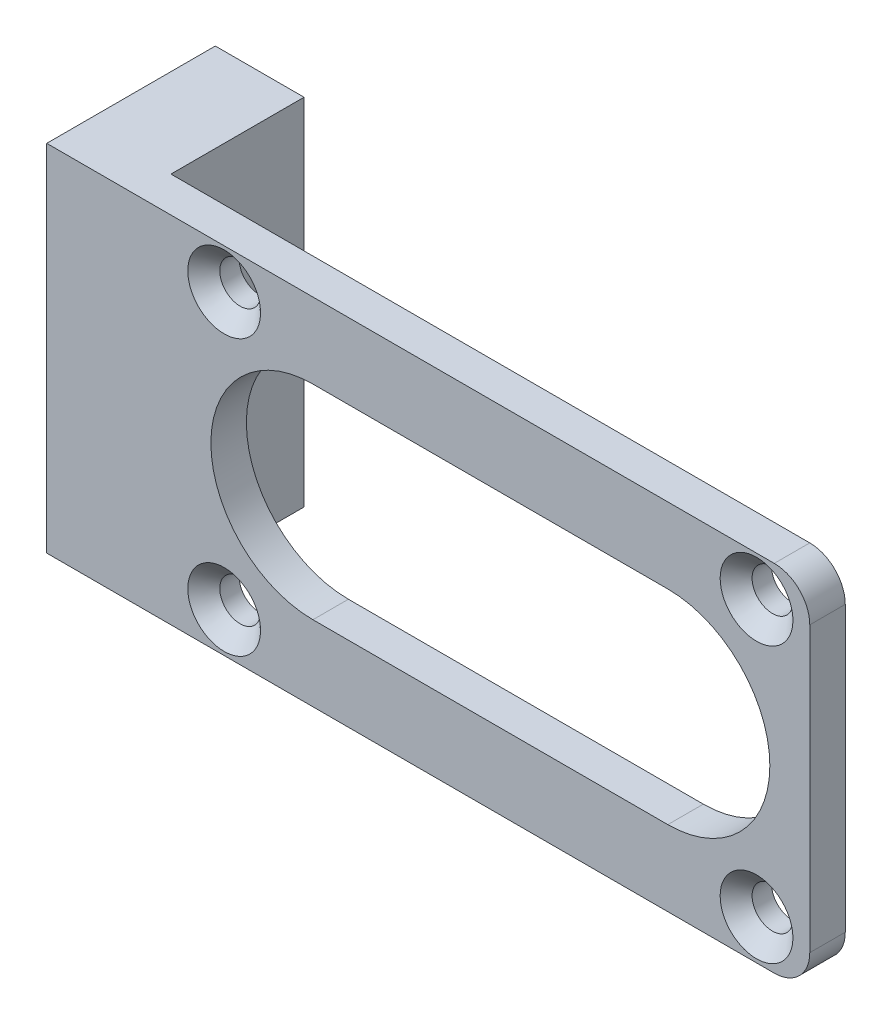
ISO-10303-21;
HEADER;
FILE_DESCRIPTION(('STEP AP214'),'2;1');
FILE_NAME('part.step','',(''),(''),'','','');
FILE_SCHEMA(('AUTOMOTIVE_DESIGN { 1 0 10303 214 1 1 1 1 }'));
ENDSEC;
DATA;
#1=APPLICATION_CONTEXT('core data for automotive mechanical design processes');
#2=APPLICATION_PROTOCOL_DEFINITION('international standard','automotive_design',2000,#1);
#3=PRODUCT_CONTEXT('',#1,'mechanical');
#4=PRODUCT('Part','Part','',(#3));
#5=PRODUCT_RELATED_PRODUCT_CATEGORY('part','',(#4));
#6=PRODUCT_DEFINITION_FORMATION('','',#4);
#7=PRODUCT_DEFINITION_CONTEXT('part definition',#1,'design');
#8=PRODUCT_DEFINITION('design','',#6,#7);
#9=PRODUCT_DEFINITION_SHAPE('','',#8);
#10=(LENGTH_UNIT() NAMED_UNIT(*) SI_UNIT(.MILLI.,.METRE.));
#11=(NAMED_UNIT(*) PLANE_ANGLE_UNIT() SI_UNIT($,.RADIAN.));
#12=(NAMED_UNIT(*) SI_UNIT($,.STERADIAN.) SOLID_ANGLE_UNIT());
#13=UNCERTAINTY_MEASURE_WITH_UNIT(LENGTH_MEASURE(1.E-05),#10,'distance_accuracy_value','');
#14=(GEOMETRIC_REPRESENTATION_CONTEXT(3) GLOBAL_UNCERTAINTY_ASSIGNED_CONTEXT((#13)) GLOBAL_UNIT_ASSIGNED_CONTEXT((#10,
#11,#12)) REPRESENTATION_CONTEXT('',''));
#15=CARTESIAN_POINT('',(0.,0.,0.));
#16=DIRECTION('',(0.,0.,1.));
#17=DIRECTION('',(1.,0.,0.));
#18=AXIS2_PLACEMENT_3D('',#15,#16,#17);
#19=CARTESIAN_POINT('',(0.,0.,2.));
#20=DIRECTION('',(0.,1.,0.));
#21=DIRECTION('',(0.,0.,1.));
#22=AXIS2_PLACEMENT_3D('',#19,#20,#21);
#23=PLANE('',#22);
#24=DIRECTION('',(1.,0.,0.));
#25=VECTOR('',#24,1.);
#26=CARTESIAN_POINT('',(0.,0.,0.));
#27=LINE('',#26,#25);
#28=CARTESIAN_POINT('',(0.,0.,0.));
#29=VERTEX_POINT('',#28);
#30=CARTESIAN_POINT('',(36.,0.,0.));
#31=VERTEX_POINT('',#30);
#32=EDGE_CURVE('E202',#29,#31,#27,.T.);
#33=ORIENTED_EDGE('',*,*,#32,.T.);
#34=DIRECTION('',(0.,0.,-1.));
#35=VECTOR('',#34,1.);
#36=CARTESIAN_POINT('',(36.,0.,2.));
#37=LINE('',#36,#35);
#38=CARTESIAN_POINT('',(36.,0.,2.));
#39=VERTEX_POINT('',#38);
#40=EDGE_CURVE('E57',#31,#39,#37,.F.);
#41=ORIENTED_EDGE('',*,*,#40,.T.);
#42=DIRECTION('',(1.,0.,0.));
#43=VECTOR('',#42,1.);
#44=CARTESIAN_POINT('',(0.,0.,2.));
#45=LINE('',#44,#43);
#46=CARTESIAN_POINT('',(-5.,0.,2.));
#47=VERTEX_POINT('',#46);
#48=EDGE_CURVE('E194',#47,#39,#45,.T.);
#49=ORIENTED_EDGE('',*,*,#48,.F.);
#50=DIRECTION('',(0.,0.,1.));
#51=VECTOR('',#50,1.);
#52=CARTESIAN_POINT('',(-5.,0.,-5.));
#53=LINE('',#52,#51);
#54=CARTESIAN_POINT('',(-5.,0.,-7.5));
#55=VERTEX_POINT('',#54);
#56=EDGE_CURVE('E190',#55,#47,#53,.T.);
#57=ORIENTED_EDGE('',*,*,#56,.F.);
#58=DIRECTION('',(-1.,0.,0.));
#59=VECTOR('',#58,1.);
#60=CARTESIAN_POINT('',(0.,0.,-7.5));
#61=LINE('',#60,#59);
#62=CARTESIAN_POINT('',(0.,0.,-7.5));
#63=VERTEX_POINT('',#62);
#64=EDGE_CURVE('E148',#63,#55,#61,.T.);
#65=ORIENTED_EDGE('',*,*,#64,.F.);
#66=DIRECTION('',(0.,0.,1.));
#67=VECTOR('',#66,1.);
#68=CARTESIAN_POINT('',(0.,0.,-5.));
#69=LINE('',#68,#67);
#70=EDGE_CURVE('E144',#63,#29,#69,.T.);
#71=ORIENTED_EDGE('',*,*,#70,.T.);
#72=EDGE_LOOP('',(#33,#41,#49,#57,#65,#71));
#73=FACE_BOUND('',#72,.T.);
#74=ADVANCED_FACE('F34',(#73),#23,.F.);
#75=CARTESIAN_POINT('',(38.,0.,2.));
#76=DIRECTION('',(-1.,0.,0.));
#77=DIRECTION('',(0.,0.,1.));
#78=AXIS2_PLACEMENT_3D('',#75,#76,#77);
#79=PLANE('',#78);
#80=DIRECTION('',(0.,1.,0.));
#81=VECTOR('',#80,1.);
#82=CARTESIAN_POINT('',(38.,0.,2.));
#83=LINE('',#82,#81);
#84=CARTESIAN_POINT('',(38.,2.,2.));
#85=VERTEX_POINT('',#84);
#86=CARTESIAN_POINT('',(38.,18.,2.));
#87=VERTEX_POINT('',#86);
#88=EDGE_CURVE('E196',#85,#87,#83,.T.);
#89=ORIENTED_EDGE('',*,*,#88,.F.);
#90=DIRECTION('',(0.,0.,-1.));
#91=VECTOR('',#90,1.);
#92=CARTESIAN_POINT('',(38.,2.,2.));
#93=LINE('',#92,#91);
#94=CARTESIAN_POINT('',(38.,2.,0.));
#95=VERTEX_POINT('',#94);
#96=EDGE_CURVE('E228',#85,#95,#93,.T.);
#97=ORIENTED_EDGE('',*,*,#96,.T.);
#98=DIRECTION('',(0.,1.,0.));
#99=VECTOR('',#98,1.);
#100=CARTESIAN_POINT('',(38.,0.,0.));
#101=LINE('',#100,#99);
#102=CARTESIAN_POINT('',(38.,18.,0.));
#103=VERTEX_POINT('',#102);
#104=EDGE_CURVE('E204',#95,#103,#101,.T.);
#105=ORIENTED_EDGE('',*,*,#104,.T.);
#106=DIRECTION('',(0.,0.,-1.));
#107=VECTOR('',#106,1.);
#108=CARTESIAN_POINT('',(38.,18.,2.));
#109=LINE('',#108,#107);
#110=EDGE_CURVE('E226',#103,#87,#109,.F.);
#111=ORIENTED_EDGE('',*,*,#110,.T.);
#112=EDGE_LOOP('',(#89,#97,#105,#111));
#113=FACE_BOUND('',#112,.T.);
#114=ADVANCED_FACE('F278',(#113),#79,.F.);
#115=CARTESIAN_POINT('',(0.,20.,2.));
#116=DIRECTION('',(0.,-1.,0.));
#117=DIRECTION('',(0.,0.,-1.));
#118=AXIS2_PLACEMENT_3D('',#115,#116,#117);
#119=PLANE('',#118);
#120=DIRECTION('',(-1.,0.,0.));
#121=VECTOR('',#120,1.);
#122=CARTESIAN_POINT('',(0.,20.,2.));
#123=LINE('',#122,#121);
#124=CARTESIAN_POINT('',(36.,20.,2.));
#125=VERTEX_POINT('',#124);
#126=CARTESIAN_POINT('',(-5.,20.,2.));
#127=VERTEX_POINT('',#126);
#128=EDGE_CURVE('E198',#125,#127,#123,.T.);
#129=ORIENTED_EDGE('',*,*,#128,.F.);
#130=DIRECTION('',(0.,0.,-1.));
#131=VECTOR('',#130,1.);
#132=CARTESIAN_POINT('',(36.,20.,2.));
#133=LINE('',#132,#131);
#134=CARTESIAN_POINT('',(36.,20.,0.));
#135=VERTEX_POINT('',#134);
#136=EDGE_CURVE('E239',#125,#135,#133,.T.);
#137=ORIENTED_EDGE('',*,*,#136,.T.);
#138=DIRECTION('',(-1.,0.,0.));
#139=VECTOR('',#138,1.);
#140=CARTESIAN_POINT('',(0.,20.,0.));
#141=LINE('',#140,#139);
#142=CARTESIAN_POINT('',(0.,20.,0.));
#143=VERTEX_POINT('',#142);
#144=EDGE_CURVE('E133',#135,#143,#141,.T.);
#145=ORIENTED_EDGE('',*,*,#144,.T.);
#146=DIRECTION('',(0.,0.,1.));
#147=VECTOR('',#146,1.);
#148=CARTESIAN_POINT('',(0.,20.,-5.));
#149=LINE('',#148,#147);
#150=CARTESIAN_POINT('',(0.,20.,-7.5));
#151=VERTEX_POINT('',#150);
#152=EDGE_CURVE('E125',#151,#143,#149,.T.);
#153=ORIENTED_EDGE('',*,*,#152,.F.);
#154=DIRECTION('',(1.,0.,0.));
#155=VECTOR('',#154,1.);
#156=CARTESIAN_POINT('',(-5.,20.,-7.5));
#157=LINE('',#156,#155);
#158=CARTESIAN_POINT('',(-5.,20.,-7.5));
#159=VERTEX_POINT('',#158);
#160=EDGE_CURVE('E130',#159,#151,#157,.T.);
#161=ORIENTED_EDGE('',*,*,#160,.F.);
#162=DIRECTION('',(0.,0.,1.));
#163=VECTOR('',#162,1.);
#164=CARTESIAN_POINT('',(-5.,20.,-5.));
#165=LINE('',#164,#163);
#166=EDGE_CURVE('E137',#159,#127,#165,.T.);
#167=ORIENTED_EDGE('',*,*,#166,.T.);
#168=EDGE_LOOP('',(#129,#137,#145,#153,#161,#167));
#169=FACE_BOUND('',#168,.T.);
#170=ADVANCED_FACE('F127',(#169),#119,.F.);
#171=CARTESIAN_POINT('',(0.,0.,2.));
#172=DIRECTION('',(0.,0.,-1.));
#173=DIRECTION('',(-1.,0.,0.));
#174=AXIS2_PLACEMENT_3D('',#171,#172,#173);
#175=PLANE('',#174);
#176=CARTESIAN_POINT('',(5.,2.25,2.));
#177=DIRECTION('',(0.,0.,-1.));
#178=DIRECTION('',(-1.,0.,0.));
#179=AXIS2_PLACEMENT_3D('',#176,#177,#178);
#180=CIRCLE('',#179,2.05);
#181=CARTESIAN_POINT('',(2.95,2.25,2.));
#182=VERTEX_POINT('',#181);
#183=EDGE_CURVE('E253',#182,#182,#180,.T.);
#184=ORIENTED_EDGE('',*,*,#183,.T.);
#185=EDGE_LOOP('',(#184));
#186=FACE_BOUND('',#185,.T.);
#187=CARTESIAN_POINT('',(35.,2.25000000000001,2.));
#188=DIRECTION('',(0.,0.,-1.));
#189=DIRECTION('',(-1.,0.,0.));
#190=AXIS2_PLACEMENT_3D('',#187,#188,#189);
#191=CIRCLE('',#190,2.05);
#192=CARTESIAN_POINT('',(32.95,2.25000000000001,2.));
#193=VERTEX_POINT('',#192);
#194=EDGE_CURVE('E250',#193,#193,#191,.T.);
#195=ORIENTED_EDGE('',*,*,#194,.T.);
#196=EDGE_LOOP('',(#195));
#197=FACE_BOUND('',#196,.T.);
#198=CARTESIAN_POINT('',(35.,17.75,2.));
#199=DIRECTION('',(0.,0.,-1.));
#200=DIRECTION('',(-1.,0.,0.));
#201=AXIS2_PLACEMENT_3D('',#198,#199,#200);
#202=CIRCLE('',#201,2.05);
#203=CARTESIAN_POINT('',(32.95,17.75,2.));
#204=VERTEX_POINT('',#203);
#205=EDGE_CURVE('E247',#204,#204,#202,.T.);
#206=ORIENTED_EDGE('',*,*,#205,.T.);
#207=EDGE_LOOP('',(#206));
#208=FACE_BOUND('',#207,.T.);
#209=CARTESIAN_POINT('',(5.,17.75,2.));
#210=DIRECTION('',(0.,0.,-1.));
#211=DIRECTION('',(-1.,0.,0.));
#212=AXIS2_PLACEMENT_3D('',#209,#210,#211);
#213=CIRCLE('',#212,2.05);
#214=CARTESIAN_POINT('',(2.94999999999999,17.75,2.));
#215=VERTEX_POINT('',#214);
#216=EDGE_CURVE('E244',#215,#215,#213,.T.);
#217=ORIENTED_EDGE('',*,*,#216,.T.);
#218=EDGE_LOOP('',(#217));
#219=FACE_BOUND('',#218,.T.);
#220=DIRECTION('',(-1.,0.,0.));
#221=VECTOR('',#220,1.);
#222=CARTESIAN_POINT('',(30.,15.75,2.));
#223=LINE('',#222,#221);
#224=CARTESIAN_POINT('',(30.,15.75,2.));
#225=VERTEX_POINT('',#224);
#226=CARTESIAN_POINT('',(10.,15.75,2.));
#227=VERTEX_POINT('',#226);
#228=EDGE_CURVE('E160',#225,#227,#223,.T.);
#229=ORIENTED_EDGE('',*,*,#228,.F.);
#230=CARTESIAN_POINT('',(30.,10.,2.));
#231=DIRECTION('',(0.,0.,1.));
#232=DIRECTION('',(1.,0.,0.));
#233=AXIS2_PLACEMENT_3D('',#230,#231,#232);
#234=CIRCLE('',#233,5.75);
#235=CARTESIAN_POINT('',(30.,4.25,2.));
#236=VERTEX_POINT('',#235);
#237=EDGE_CURVE('E158',#236,#225,#234,.T.);
#238=ORIENTED_EDGE('',*,*,#237,.F.);
#239=DIRECTION('',(1.,0.,0.));
#240=VECTOR('',#239,1.);
#241=CARTESIAN_POINT('',(30.,4.25,2.));
#242=LINE('',#241,#240);
#243=CARTESIAN_POINT('',(10.,4.24999999999999,2.));
#244=VERTEX_POINT('',#243);
#245=EDGE_CURVE('E166',#244,#236,#242,.T.);
#246=ORIENTED_EDGE('',*,*,#245,.F.);
#247=CARTESIAN_POINT('',(10.,10.,2.));
#248=DIRECTION('',(0.,0.,1.));
#249=DIRECTION('',(1.,0.,0.));
#250=AXIS2_PLACEMENT_3D('',#247,#248,#249);
#251=CIRCLE('',#250,5.75);
#252=EDGE_CURVE('E163',#227,#244,#251,.T.);
#253=ORIENTED_EDGE('',*,*,#252,.F.);
#254=EDGE_LOOP('',(#229,#238,#246,#253));
#255=FACE_BOUND('',#254,.T.);
#256=ORIENTED_EDGE('',*,*,#48,.T.);
#257=CARTESIAN_POINT('',(36.,2.,2.));
#258=DIRECTION('',(0.,0.,-1.));
#259=DIRECTION('',(-1.,0.,0.));
#260=AXIS2_PLACEMENT_3D('',#257,#258,#259);
#261=CIRCLE('',#260,2.);
#262=EDGE_CURVE('E237',#39,#85,#261,.F.);
#263=ORIENTED_EDGE('',*,*,#262,.T.);
#264=ORIENTED_EDGE('',*,*,#88,.T.);
#265=CARTESIAN_POINT('',(36.,18.,2.));
#266=DIRECTION('',(0.,0.,-1.));
#267=DIRECTION('',(-1.,0.,0.));
#268=AXIS2_PLACEMENT_3D('',#265,#266,#267);
#269=CIRCLE('',#268,2.);
#270=EDGE_CURVE('E49',#87,#125,#269,.F.);
#271=ORIENTED_EDGE('',*,*,#270,.T.);
#272=ORIENTED_EDGE('',*,*,#128,.T.);
#273=DIRECTION('',(0.,-1.,0.));
#274=VECTOR('',#273,1.);
#275=CARTESIAN_POINT('',(-5.,20.,2.));
#276=LINE('',#275,#274);
#277=EDGE_CURVE('E138',#127,#47,#276,.T.);
#278=ORIENTED_EDGE('',*,*,#277,.T.);
#279=EDGE_LOOP('',(#256,#263,#264,#271,#272,#278));
#280=FACE_BOUND('',#279,.T.);
#281=ADVANCED_FACE('F313',(#186,#197,#208,#219,#255,#280),#175,.F.);
#282=CARTESIAN_POINT('',(0.,0.,0.));
#283=DIRECTION('',(0.,0.,-1.));
#284=DIRECTION('',(-1.,0.,0.));
#285=AXIS2_PLACEMENT_3D('',#282,#283,#284);
#286=PLANE('',#285);
#287=CARTESIAN_POINT('',(30.,10.,0.));
#288=DIRECTION('',(0.,0.,-1.));
#289=DIRECTION('',(-1.,0.,0.));
#290=AXIS2_PLACEMENT_3D('',#287,#288,#289);
#291=CIRCLE('',#290,5.75);
#292=CARTESIAN_POINT('',(30.,15.75,0.));
#293=VERTEX_POINT('',#292);
#294=CARTESIAN_POINT('',(30.,4.25,0.));
#295=VERTEX_POINT('',#294);
#296=EDGE_CURVE('E224',#293,#295,#291,.T.);
#297=ORIENTED_EDGE('',*,*,#296,.F.);
#298=DIRECTION('',(1.,0.,0.));
#299=VECTOR('',#298,1.);
#300=CARTESIAN_POINT('',(0.,15.75,0.));
#301=LINE('',#300,#299);
#302=CARTESIAN_POINT('',(10.,15.75,0.));
#303=VERTEX_POINT('',#302);
#304=EDGE_CURVE('E200',#303,#293,#301,.T.);
#305=ORIENTED_EDGE('',*,*,#304,.F.);
#306=CARTESIAN_POINT('',(10.,10.,0.));
#307=DIRECTION('',(0.,0.,-1.));
#308=DIRECTION('',(-1.,0.,0.));
#309=AXIS2_PLACEMENT_3D('',#306,#307,#308);
#310=CIRCLE('',#309,5.75);
#311=CARTESIAN_POINT('',(10.,4.24999999999999,0.));
#312=VERTEX_POINT('',#311);
#313=EDGE_CURVE('E219',#312,#303,#310,.T.);
#314=ORIENTED_EDGE('',*,*,#313,.F.);
#315=DIRECTION('',(-1.,0.,0.));
#316=VECTOR('',#315,1.);
#317=CARTESIAN_POINT('',(0.,4.24999999999999,0.));
#318=LINE('',#317,#316);
#319=EDGE_CURVE('E222',#295,#312,#318,.T.);
#320=ORIENTED_EDGE('',*,*,#319,.F.);
#321=EDGE_LOOP('',(#297,#305,#314,#320));
#322=FACE_BOUND('',#321,.T.);
#323=CARTESIAN_POINT('',(5.,17.75,0.));
#324=DIRECTION('',(0.,0.,-1.));
#325=DIRECTION('',(-1.,0.,0.));
#326=AXIS2_PLACEMENT_3D('',#323,#324,#325);
#327=CIRCLE('',#326,1.15);
#328=CARTESIAN_POINT('',(3.85,17.75,0.));
#329=VERTEX_POINT('',#328);
#330=EDGE_CURVE('E183',#329,#329,#327,.T.);
#331=ORIENTED_EDGE('',*,*,#330,.F.);
#332=EDGE_LOOP('',(#331));
#333=FACE_BOUND('',#332,.T.);
#334=CARTESIAN_POINT('',(35.,2.25000000000001,0.));
#335=DIRECTION('',(0.,0.,-1.));
#336=DIRECTION('',(-1.,0.,0.));
#337=AXIS2_PLACEMENT_3D('',#334,#335,#336);
#338=CIRCLE('',#337,1.15);
#339=CARTESIAN_POINT('',(33.85,2.25000000000001,0.));
#340=VERTEX_POINT('',#339);
#341=EDGE_CURVE('E213',#340,#340,#338,.T.);
#342=ORIENTED_EDGE('',*,*,#341,.F.);
#343=EDGE_LOOP('',(#342));
#344=FACE_BOUND('',#343,.T.);
#345=CARTESIAN_POINT('',(5.,2.25,0.));
#346=DIRECTION('',(0.,0.,-1.));
#347=DIRECTION('',(-1.,0.,0.));
#348=AXIS2_PLACEMENT_3D('',#345,#346,#347);
#349=CIRCLE('',#348,1.15);
#350=CARTESIAN_POINT('',(3.85,2.25,0.));
#351=VERTEX_POINT('',#350);
#352=EDGE_CURVE('E210',#351,#351,#349,.T.);
#353=ORIENTED_EDGE('',*,*,#352,.F.);
#354=EDGE_LOOP('',(#353));
#355=FACE_BOUND('',#354,.T.);
#356=CARTESIAN_POINT('',(35.,17.75,0.));
#357=DIRECTION('',(0.,0.,-1.));
#358=DIRECTION('',(-1.,0.,0.));
#359=AXIS2_PLACEMENT_3D('',#356,#357,#358);
#360=CIRCLE('',#359,1.15);
#361=CARTESIAN_POINT('',(33.85,17.75,0.));
#362=VERTEX_POINT('',#361);
#363=EDGE_CURVE('E172',#362,#362,#360,.T.);
#364=ORIENTED_EDGE('',*,*,#363,.F.);
#365=EDGE_LOOP('',(#364));
#366=FACE_BOUND('',#365,.T.);
#367=ORIENTED_EDGE('',*,*,#104,.F.);
#368=CARTESIAN_POINT('',(36.,2.,0.));
#369=DIRECTION('',(0.,0.,-1.));
#370=DIRECTION('',(-1.,0.,0.));
#371=AXIS2_PLACEMENT_3D('',#368,#369,#370);
#372=CIRCLE('',#371,2.);
#373=EDGE_CURVE('E233',#95,#31,#372,.T.);
#374=ORIENTED_EDGE('',*,*,#373,.T.);
#375=ORIENTED_EDGE('',*,*,#32,.F.);
#376=DIRECTION('',(0.,-1.,0.));
#377=VECTOR('',#376,1.);
#378=CARTESIAN_POINT('',(0.,0.,0.));
#379=LINE('',#378,#377);
#380=EDGE_CURVE('E189',#143,#29,#379,.T.);
#381=ORIENTED_EDGE('',*,*,#380,.F.);
#382=ORIENTED_EDGE('',*,*,#144,.F.);
#383=CARTESIAN_POINT('',(36.,18.,0.));
#384=DIRECTION('',(0.,0.,-1.));
#385=DIRECTION('',(-1.,0.,0.));
#386=AXIS2_PLACEMENT_3D('',#383,#384,#385);
#387=CIRCLE('',#386,2.);
#388=EDGE_CURVE('E231',#135,#103,#387,.T.);
#389=ORIENTED_EDGE('',*,*,#388,.T.);
#390=EDGE_LOOP('',(#367,#374,#375,#381,#382,#389));
#391=FACE_BOUND('',#390,.T.);
#392=ADVANCED_FACE('F310',(#322,#333,#344,#355,#366,#391),#286,.T.);
#393=CARTESIAN_POINT('',(0.,20.,-5.));
#394=DIRECTION('',(1.,0.,0.));
#395=DIRECTION('',(0.,1.,0.));
#396=AXIS2_PLACEMENT_3D('',#393,#394,#395);
#397=PLANE('',#396);
#398=CARTESIAN_POINT('',(0.,10.,-2.5));
#399=DIRECTION('',(1.,0.,0.));
#400=DIRECTION('',(0.,1.,0.));
#401=AXIS2_PLACEMENT_3D('',#398,#399,#400);
#402=CIRCLE('',#401,1.24999999999999);
#403=CARTESIAN_POINT('',(0.,11.25,-2.5));
#404=VERTEX_POINT('',#403);
#405=EDGE_CURVE('E182',#404,#404,#402,.T.);
#406=ORIENTED_EDGE('',*,*,#405,.F.);
#407=EDGE_LOOP('',(#406));
#408=FACE_BOUND('',#407,.T.);
#409=ORIENTED_EDGE('',*,*,#152,.T.);
#410=ORIENTED_EDGE('',*,*,#380,.T.);
#411=ORIENTED_EDGE('',*,*,#70,.F.);
#412=DIRECTION('',(0.,-1.,0.));
#413=VECTOR('',#412,1.);
#414=CARTESIAN_POINT('',(0.,20.,-7.5));
#415=LINE('',#414,#413);
#416=EDGE_CURVE('E141',#151,#63,#415,.T.);
#417=ORIENTED_EDGE('',*,*,#416,.F.);
#418=EDGE_LOOP('',(#409,#410,#411,#417));
#419=FACE_BOUND('',#418,.T.);
#420=ADVANCED_FACE('F142',(#408,#419),#397,.T.);
#421=CARTESIAN_POINT('',(-5.,20.,-5.));
#422=DIRECTION('',(-1.,0.,0.));
#423=DIRECTION('',(0.,-1.,0.));
#424=AXIS2_PLACEMENT_3D('',#421,#422,#423);
#425=PLANE('',#424);
#426=CARTESIAN_POINT('',(-5.,10.,-2.5));
#427=DIRECTION('',(-1.,0.,0.));
#428=DIRECTION('',(0.,0.,1.));
#429=AXIS2_PLACEMENT_3D('',#426,#427,#428);
#430=CIRCLE('',#429,1.24999999999999);
#431=CARTESIAN_POINT('',(-5.,10.,-1.25000000000001));
#432=VERTEX_POINT('',#431);
#433=EDGE_CURVE('E179',#432,#432,#430,.T.);
#434=ORIENTED_EDGE('',*,*,#433,.F.);
#435=EDGE_LOOP('',(#434));
#436=FACE_BOUND('',#435,.T.);
#437=ORIENTED_EDGE('',*,*,#277,.F.);
#438=ORIENTED_EDGE('',*,*,#166,.F.);
#439=DIRECTION('',(0.,1.,0.));
#440=VECTOR('',#439,1.);
#441=CARTESIAN_POINT('',(-5.,0.,-7.5));
#442=LINE('',#441,#440);
#443=EDGE_CURVE('E153',#55,#159,#442,.T.);
#444=ORIENTED_EDGE('',*,*,#443,.F.);
#445=ORIENTED_EDGE('',*,*,#56,.T.);
#446=EDGE_LOOP('',(#437,#438,#444,#445));
#447=FACE_BOUND('',#446,.T.);
#448=ADVANCED_FACE('F325',(#436,#447),#425,.T.);
#449=CARTESIAN_POINT('',(-5.,10.,-2.5));
#450=DIRECTION('',(-1.,0.,0.));
#451=DIRECTION('',(0.,0.,1.));
#452=AXIS2_PLACEMENT_3D('',#449,#450,#451);
#453=CYLINDRICAL_SURFACE('',#452,1.24999999999999);
#454=ORIENTED_EDGE('',*,*,#405,.T.);
#455=EDGE_LOOP('',(#454));
#456=FACE_BOUND('',#455,.T.);
#457=ORIENTED_EDGE('',*,*,#433,.T.);
#458=EDGE_LOOP('',(#457));
#459=FACE_BOUND('',#458,.T.);
#460=ADVANCED_FACE('F340',(#456,#459),#453,.F.);
#461=CARTESIAN_POINT('',(35.,17.75,-5.5));
#462=DIRECTION('',(0.,0.,1.));
#463=DIRECTION('',(1.,0.,0.));
#464=AXIS2_PLACEMENT_3D('',#461,#462,#463);
#465=CYLINDRICAL_SURFACE('',#464,1.15);
#466=CARTESIAN_POINT('',(35.,17.75,1.1));
#467=DIRECTION('',(0.,0.,-1.));
#468=DIRECTION('',(-1.,0.,0.));
#469=AXIS2_PLACEMENT_3D('',#466,#467,#468);
#470=CIRCLE('',#469,1.15);
#471=CARTESIAN_POINT('',(33.85,17.75,1.1));
#472=VERTEX_POINT('',#471);
#473=EDGE_CURVE('E42',#472,#472,#470,.F.);
#474=ORIENTED_EDGE('',*,*,#473,.T.);
#475=EDGE_LOOP('',(#474));
#476=FACE_BOUND('',#475,.T.);
#477=ORIENTED_EDGE('',*,*,#363,.T.);
#478=EDGE_LOOP('',(#477));
#479=FACE_BOUND('',#478,.T.);
#480=ADVANCED_FACE('F261',(#476,#479),#465,.F.);
#481=CARTESIAN_POINT('',(5.,2.25,-5.5));
#482=DIRECTION('',(0.,0.,1.));
#483=DIRECTION('',(1.,0.,0.));
#484=AXIS2_PLACEMENT_3D('',#481,#482,#483);
#485=CYLINDRICAL_SURFACE('',#484,1.15);
#486=CARTESIAN_POINT('',(5.,2.25,1.10000000000001));
#487=DIRECTION('',(0.,0.,-1.));
#488=DIRECTION('',(-1.,0.,0.));
#489=AXIS2_PLACEMENT_3D('',#486,#487,#488);
#490=CIRCLE('',#489,1.15);
#491=CARTESIAN_POINT('',(3.85,2.25,1.10000000000001));
#492=VERTEX_POINT('',#491);
#493=EDGE_CURVE('E241',#492,#492,#490,.F.);
#494=ORIENTED_EDGE('',*,*,#493,.T.);
#495=EDGE_LOOP('',(#494));
#496=FACE_BOUND('',#495,.T.);
#497=ORIENTED_EDGE('',*,*,#352,.T.);
#498=EDGE_LOOP('',(#497));
#499=FACE_BOUND('',#498,.T.);
#500=ADVANCED_FACE('F303',(#496,#499),#485,.F.);
#501=CARTESIAN_POINT('',(35.,2.25000000000001,-5.5));
#502=DIRECTION('',(0.,0.,1.));
#503=DIRECTION('',(1.,0.,0.));
#504=AXIS2_PLACEMENT_3D('',#501,#502,#503);
#505=CYLINDRICAL_SURFACE('',#504,1.15);
#506=CARTESIAN_POINT('',(35.,2.25000000000001,1.1));
#507=DIRECTION('',(0.,0.,-1.));
#508=DIRECTION('',(-1.,0.,0.));
#509=AXIS2_PLACEMENT_3D('',#506,#507,#508);
#510=CIRCLE('',#509,1.15);
#511=CARTESIAN_POINT('',(33.85,2.25000000000001,1.1));
#512=VERTEX_POINT('',#511);
#513=EDGE_CURVE('E256',#512,#512,#510,.F.);
#514=ORIENTED_EDGE('',*,*,#513,.T.);
#515=EDGE_LOOP('',(#514));
#516=FACE_BOUND('',#515,.T.);
#517=ORIENTED_EDGE('',*,*,#341,.T.);
#518=EDGE_LOOP('',(#517));
#519=FACE_BOUND('',#518,.T.);
#520=ADVANCED_FACE('F306',(#516,#519),#505,.F.);
#521=CARTESIAN_POINT('',(5.,17.75,-5.5));
#522=DIRECTION('',(0.,0.,1.));
#523=DIRECTION('',(1.,0.,0.));
#524=AXIS2_PLACEMENT_3D('',#521,#522,#523);
#525=CYLINDRICAL_SURFACE('',#524,1.15);
#526=CARTESIAN_POINT('',(5.,17.75,1.1));
#527=DIRECTION('',(0.,0.,-1.));
#528=DIRECTION('',(-1.,0.,0.));
#529=AXIS2_PLACEMENT_3D('',#526,#527,#528);
#530=CIRCLE('',#529,1.15);
#531=CARTESIAN_POINT('',(3.85,17.75,1.1));
#532=VERTEX_POINT('',#531);
#533=EDGE_CURVE('E11',#532,#532,#530,.F.);
#534=ORIENTED_EDGE('',*,*,#533,.T.);
#535=EDGE_LOOP('',(#534));
#536=FACE_BOUND('',#535,.T.);
#537=ORIENTED_EDGE('',*,*,#330,.T.);
#538=EDGE_LOOP('',(#537));
#539=FACE_BOUND('',#538,.T.);
#540=ADVANCED_FACE('F349',(#536,#539),#525,.F.);
#541=CARTESIAN_POINT('',(30.,10.,-5.5));
#542=DIRECTION('',(0.,0.,1.));
#543=DIRECTION('',(1.,0.,0.));
#544=AXIS2_PLACEMENT_3D('',#541,#542,#543);
#545=CYLINDRICAL_SURFACE('',#544,5.75);
#546=ORIENTED_EDGE('',*,*,#296,.T.);
#547=DIRECTION('',(0.,0.,1.));
#548=VECTOR('',#547,1.);
#549=CARTESIAN_POINT('',(30.,4.25,-5.5));
#550=LINE('',#549,#548);
#551=EDGE_CURVE('E170',#295,#236,#550,.T.);
#552=ORIENTED_EDGE('',*,*,#551,.T.);
#553=ORIENTED_EDGE('',*,*,#237,.T.);
#554=DIRECTION('',(0.,0.,1.));
#555=VECTOR('',#554,1.);
#556=CARTESIAN_POINT('',(30.,15.75,-5.5));
#557=LINE('',#556,#555);
#558=EDGE_CURVE('E169',#293,#225,#557,.T.);
#559=ORIENTED_EDGE('',*,*,#558,.F.);
#560=EDGE_LOOP('',(#546,#552,#553,#559));
#561=FACE_BOUND('',#560,.T.);
#562=ADVANCED_FACE('F352',(#561),#545,.F.);
#563=CARTESIAN_POINT('',(30.,4.25,-5.5));
#564=DIRECTION('',(0.,-1.,0.));
#565=DIRECTION('',(1.,0.,0.));
#566=AXIS2_PLACEMENT_3D('',#563,#564,#565);
#567=PLANE('',#566);
#568=ORIENTED_EDGE('',*,*,#319,.T.);
#569=DIRECTION('',(0.,0.,1.));
#570=VECTOR('',#569,1.);
#571=CARTESIAN_POINT('',(10.,4.24999999999999,-5.5));
#572=LINE('',#571,#570);
#573=EDGE_CURVE('E173',#312,#244,#572,.T.);
#574=ORIENTED_EDGE('',*,*,#573,.T.);
#575=ORIENTED_EDGE('',*,*,#245,.T.);
#576=ORIENTED_EDGE('',*,*,#551,.F.);
#577=EDGE_LOOP('',(#568,#574,#575,#576));
#578=FACE_BOUND('',#577,.T.);
#579=ADVANCED_FACE('F357',(#578),#567,.F.);
#580=CARTESIAN_POINT('',(10.,10.,-5.5));
#581=DIRECTION('',(0.,0.,1.));
#582=DIRECTION('',(1.,0.,0.));
#583=AXIS2_PLACEMENT_3D('',#580,#581,#582);
#584=CYLINDRICAL_SURFACE('',#583,5.75);
#585=ORIENTED_EDGE('',*,*,#313,.T.);
#586=DIRECTION('',(0.,0.,1.));
#587=VECTOR('',#586,1.);
#588=CARTESIAN_POINT('',(10.,15.75,-5.5));
#589=LINE('',#588,#587);
#590=EDGE_CURVE('E175',#303,#227,#589,.T.);
#591=ORIENTED_EDGE('',*,*,#590,.T.);
#592=ORIENTED_EDGE('',*,*,#252,.T.);
#593=ORIENTED_EDGE('',*,*,#573,.F.);
#594=EDGE_LOOP('',(#585,#591,#592,#593));
#595=FACE_BOUND('',#594,.T.);
#596=ADVANCED_FACE('F362',(#595),#584,.F.);
#597=CARTESIAN_POINT('',(30.,15.75,-5.5));
#598=DIRECTION('',(0.,1.,0.));
#599=DIRECTION('',(0.,0.,1.));
#600=AXIS2_PLACEMENT_3D('',#597,#598,#599);
#601=PLANE('',#600);
#602=ORIENTED_EDGE('',*,*,#304,.T.);
#603=ORIENTED_EDGE('',*,*,#558,.T.);
#604=ORIENTED_EDGE('',*,*,#228,.T.);
#605=ORIENTED_EDGE('',*,*,#590,.F.);
#606=EDGE_LOOP('',(#602,#603,#604,#605));
#607=FACE_BOUND('',#606,.T.);
#608=ADVANCED_FACE('F359',(#607),#601,.F.);
#609=CARTESIAN_POINT('',(0.,0.,-7.5));
#610=DIRECTION('',(0.,0.,-1.));
#611=DIRECTION('',(-1.,0.,0.));
#612=AXIS2_PLACEMENT_3D('',#609,#610,#611);
#613=PLANE('',#612);
#614=ORIENTED_EDGE('',*,*,#160,.T.);
#615=ORIENTED_EDGE('',*,*,#416,.T.);
#616=ORIENTED_EDGE('',*,*,#64,.T.);
#617=ORIENTED_EDGE('',*,*,#443,.T.);
#618=EDGE_LOOP('',(#614,#615,#616,#617));
#619=FACE_BOUND('',#618,.T.);
#620=ADVANCED_FACE('F151',(#619),#613,.T.);
#621=CARTESIAN_POINT('',(36.,2.,2.));
#622=DIRECTION('',(0.,0.,-1.));
#623=DIRECTION('',(-1.,0.,0.));
#624=AXIS2_PLACEMENT_3D('',#621,#622,#623);
#625=CYLINDRICAL_SURFACE('',#624,2.);
#626=ORIENTED_EDGE('',*,*,#262,.F.);
#627=ORIENTED_EDGE('',*,*,#40,.F.);
#628=ORIENTED_EDGE('',*,*,#373,.F.);
#629=ORIENTED_EDGE('',*,*,#96,.F.);
#630=EDGE_LOOP('',(#626,#627,#628,#629));
#631=FACE_BOUND('',#630,.T.);
#632=ADVANCED_FACE('F287',(#631),#625,.T.);
#633=CARTESIAN_POINT('',(36.,18.,2.));
#634=DIRECTION('',(0.,0.,-1.));
#635=DIRECTION('',(-1.,0.,0.));
#636=AXIS2_PLACEMENT_3D('',#633,#634,#635);
#637=CYLINDRICAL_SURFACE('',#636,2.);
#638=ORIENTED_EDGE('',*,*,#270,.F.);
#639=ORIENTED_EDGE('',*,*,#110,.F.);
#640=ORIENTED_EDGE('',*,*,#388,.F.);
#641=ORIENTED_EDGE('',*,*,#136,.F.);
#642=EDGE_LOOP('',(#638,#639,#640,#641));
#643=FACE_BOUND('',#642,.T.);
#644=ADVANCED_FACE('F290',(#643),#637,.T.);
#645=CARTESIAN_POINT('',(5.,2.25,1.10000000000001));
#646=DIRECTION('',(0.,0.,1.));
#647=DIRECTION('',(1.,0.,0.));
#648=AXIS2_PLACEMENT_3D('',#645,#646,#647);
#649=CONICAL_SURFACE('',#648,1.15,0.78539816339745);
#650=ORIENTED_EDGE('',*,*,#183,.F.);
#651=EDGE_LOOP('',(#650));
#652=FACE_BOUND('',#651,.T.);
#653=ORIENTED_EDGE('',*,*,#493,.F.);
#654=EDGE_LOOP('',(#653));
#655=FACE_BOUND('',#654,.T.);
#656=ADVANCED_FACE('F273',(#652,#655),#649,.F.);
#657=CARTESIAN_POINT('',(35.,2.25000000000001,1.1));
#658=DIRECTION('',(0.,0.,1.));
#659=DIRECTION('',(1.,0.,0.));
#660=AXIS2_PLACEMENT_3D('',#657,#658,#659);
#661=CONICAL_SURFACE('',#660,1.15,0.78539816339745);
#662=ORIENTED_EDGE('',*,*,#194,.F.);
#663=EDGE_LOOP('',(#662));
#664=FACE_BOUND('',#663,.T.);
#665=ORIENTED_EDGE('',*,*,#513,.F.);
#666=EDGE_LOOP('',(#665));
#667=FACE_BOUND('',#666,.T.);
#668=ADVANCED_FACE('F266',(#664,#667),#661,.F.);
#669=CARTESIAN_POINT('',(35.,17.75,1.1));
#670=DIRECTION('',(0.,0.,1.));
#671=DIRECTION('',(1.,0.,0.));
#672=AXIS2_PLACEMENT_3D('',#669,#670,#671);
#673=CONICAL_SURFACE('',#672,1.15,0.78539816339745);
#674=ORIENTED_EDGE('',*,*,#205,.F.);
#675=EDGE_LOOP('',(#674));
#676=FACE_BOUND('',#675,.T.);
#677=ORIENTED_EDGE('',*,*,#473,.F.);
#678=EDGE_LOOP('',(#677));
#679=FACE_BOUND('',#678,.T.);
#680=ADVANCED_FACE('F264',(#676,#679),#673,.F.);
#681=CARTESIAN_POINT('',(5.,17.75,1.1));
#682=DIRECTION('',(0.,0.,1.));
#683=DIRECTION('',(1.,0.,0.));
#684=AXIS2_PLACEMENT_3D('',#681,#682,#683);
#685=CONICAL_SURFACE('',#684,1.15,0.78539816339745);
#686=ORIENTED_EDGE('',*,*,#216,.F.);
#687=EDGE_LOOP('',(#686));
#688=FACE_BOUND('',#687,.T.);
#689=ORIENTED_EDGE('',*,*,#533,.F.);
#690=EDGE_LOOP('',(#689));
#691=FACE_BOUND('',#690,.T.);
#692=ADVANCED_FACE('F36',(#688,#691),#685,.F.);
#693=CLOSED_SHELL('',(#74,#114,#170,#281,#392,#420,#448,#460,#480,#500,#520,#540,#562,#579,#596,
#608,#620,#632,#644,#656,#668,#680,#692));
#694=MANIFOLD_SOLID_BREP('B2',#693);
#695=ADVANCED_BREP_SHAPE_REPRESENTATION('',(#18,#694),#14);
#696=SHAPE_DEFINITION_REPRESENTATION(#9,#695);
ENDSEC;
END-ISO-10303-21;
